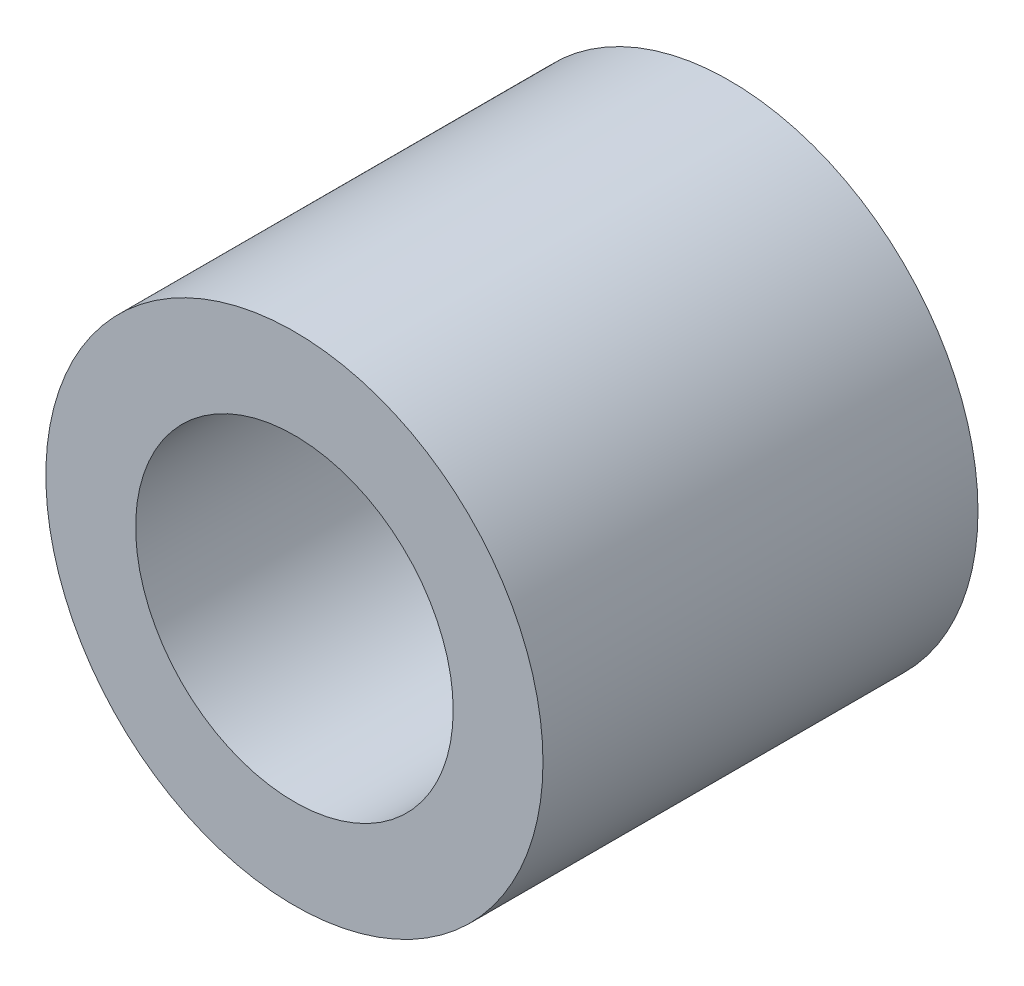
ISO-10303-21;
HEADER;
FILE_DESCRIPTION(('STEP AP214'),'2;1');
FILE_NAME('part.step','',(''),(''),'','','');
FILE_SCHEMA(('AUTOMOTIVE_DESIGN { 1 0 10303 214 1 1 1 1 }'));
ENDSEC;
DATA;
#1=APPLICATION_CONTEXT('core data for automotive mechanical design processes');
#2=APPLICATION_PROTOCOL_DEFINITION('international standard','automotive_design',2000,#1);
#3=PRODUCT_CONTEXT('',#1,'mechanical');
#4=PRODUCT('Part','Part','',(#3));
#5=PRODUCT_RELATED_PRODUCT_CATEGORY('part','',(#4));
#6=PRODUCT_DEFINITION_FORMATION('','',#4);
#7=PRODUCT_DEFINITION_CONTEXT('part definition',#1,'design');
#8=PRODUCT_DEFINITION('design','',#6,#7);
#9=PRODUCT_DEFINITION_SHAPE('','',#8);
#10=(LENGTH_UNIT() NAMED_UNIT(*) SI_UNIT(.MILLI.,.METRE.));
#11=(NAMED_UNIT(*) PLANE_ANGLE_UNIT() SI_UNIT($,.RADIAN.));
#12=(NAMED_UNIT(*) SI_UNIT($,.STERADIAN.) SOLID_ANGLE_UNIT());
#13=UNCERTAINTY_MEASURE_WITH_UNIT(LENGTH_MEASURE(1.E-05),#10,'distance_accuracy_value','');
#14=(GEOMETRIC_REPRESENTATION_CONTEXT(3) GLOBAL_UNCERTAINTY_ASSIGNED_CONTEXT((#13)) GLOBAL_UNIT_ASSIGNED_CONTEXT((#10,
#11,#12)) REPRESENTATION_CONTEXT('',''));
#15=CARTESIAN_POINT('',(0.,0.,0.));
#16=DIRECTION('',(0.,0.,1.));
#17=DIRECTION('',(1.,0.,0.));
#18=AXIS2_PLACEMENT_3D('',#15,#16,#17);
#19=CARTESIAN_POINT('',(0.,0.,7.));
#20=DIRECTION('',(0.,0.,1.));
#21=DIRECTION('',(1.,0.,0.));
#22=AXIS2_PLACEMENT_3D('',#19,#20,#21);
#23=PLANE('',#22);
#24=CARTESIAN_POINT('',(0.,0.,7.));
#25=DIRECTION('',(0.,0.,1.));
#26=DIRECTION('',(1.,0.,0.));
#27=AXIS2_PLACEMENT_3D('',#24,#25,#26);
#28=CIRCLE('',#27,4.);
#29=CARTESIAN_POINT('',(4.,0.,7.));
#30=VERTEX_POINT('',#29);
#31=EDGE_CURVE('E10',#30,#30,#28,.T.);
#32=ORIENTED_EDGE('',*,*,#31,.T.);
#33=EDGE_LOOP('',(#32));
#34=FACE_BOUND('',#33,.T.);
#35=CARTESIAN_POINT('',(0.,0.,7.));
#36=DIRECTION('',(0.,0.,1.));
#37=DIRECTION('',(1.,0.,0.));
#38=AXIS2_PLACEMENT_3D('',#35,#36,#37);
#39=CIRCLE('',#38,2.555);
#40=CARTESIAN_POINT('',(2.555,0.,7.));
#41=VERTEX_POINT('',#40);
#42=EDGE_CURVE('E47',#41,#41,#39,.T.);
#43=ORIENTED_EDGE('',*,*,#42,.F.);
#44=EDGE_LOOP('',(#43));
#45=FACE_BOUND('',#44,.T.);
#46=ADVANCED_FACE('F36',(#34,#45),#23,.T.);
#47=CARTESIAN_POINT('',(0.,0.,0.));
#48=DIRECTION('',(0.,0.,1.));
#49=DIRECTION('',(1.,0.,0.));
#50=AXIS2_PLACEMENT_3D('',#47,#48,#49);
#51=PLANE('',#50);
#52=CARTESIAN_POINT('',(0.,0.,0.));
#53=DIRECTION('',(0.,0.,1.));
#54=DIRECTION('',(1.,0.,0.));
#55=AXIS2_PLACEMENT_3D('',#52,#53,#54);
#56=CIRCLE('',#55,4.);
#57=CARTESIAN_POINT('',(4.,0.,0.));
#58=VERTEX_POINT('',#57);
#59=EDGE_CURVE('E40',#58,#58,#56,.T.);
#60=ORIENTED_EDGE('',*,*,#59,.F.);
#61=EDGE_LOOP('',(#60));
#62=FACE_BOUND('',#61,.T.);
#63=CARTESIAN_POINT('',(0.,0.,0.));
#64=DIRECTION('',(0.,0.,1.));
#65=DIRECTION('',(1.,0.,0.));
#66=AXIS2_PLACEMENT_3D('',#63,#64,#65);
#67=CIRCLE('',#66,2.555);
#68=CARTESIAN_POINT('',(2.555,0.,0.));
#69=VERTEX_POINT('',#68);
#70=EDGE_CURVE('E49',#69,#69,#67,.T.);
#71=ORIENTED_EDGE('',*,*,#70,.T.);
#72=EDGE_LOOP('',(#71));
#73=FACE_BOUND('',#72,.T.);
#74=ADVANCED_FACE('F59',(#62,#73),#51,.F.);
#75=CARTESIAN_POINT('',(0.,0.,7.));
#76=DIRECTION('',(0.,0.,-1.));
#77=DIRECTION('',(-1.,0.,0.));
#78=AXIS2_PLACEMENT_3D('',#75,#76,#77);
#79=CYLINDRICAL_SURFACE('',#78,4.);
#80=ORIENTED_EDGE('',*,*,#31,.F.);
#81=EDGE_LOOP('',(#80));
#82=FACE_BOUND('',#81,.T.);
#83=ORIENTED_EDGE('',*,*,#59,.T.);
#84=EDGE_LOOP('',(#83));
#85=FACE_BOUND('',#84,.T.);
#86=ADVANCED_FACE('F38',(#82,#85),#79,.T.);
#87=CARTESIAN_POINT('',(0.,0.,7.));
#88=DIRECTION('',(0.,0.,-1.));
#89=DIRECTION('',(-1.,0.,0.));
#90=AXIS2_PLACEMENT_3D('',#87,#88,#89);
#91=CYLINDRICAL_SURFACE('',#90,2.555);
#92=ORIENTED_EDGE('',*,*,#42,.T.);
#93=EDGE_LOOP('',(#92));
#94=FACE_BOUND('',#93,.T.);
#95=ORIENTED_EDGE('',*,*,#70,.F.);
#96=EDGE_LOOP('',(#95));
#97=FACE_BOUND('',#96,.T.);
#98=ADVANCED_FACE('F55',(#94,#97),#91,.F.);
#99=CLOSED_SHELL('',(#46,#74,#86,#98));
#100=MANIFOLD_SOLID_BREP('B2',#99);
#101=ADVANCED_BREP_SHAPE_REPRESENTATION('',(#18,#100),#14);
#102=SHAPE_DEFINITION_REPRESENTATION(#9,#101);
ENDSEC;
END-ISO-10303-21;
